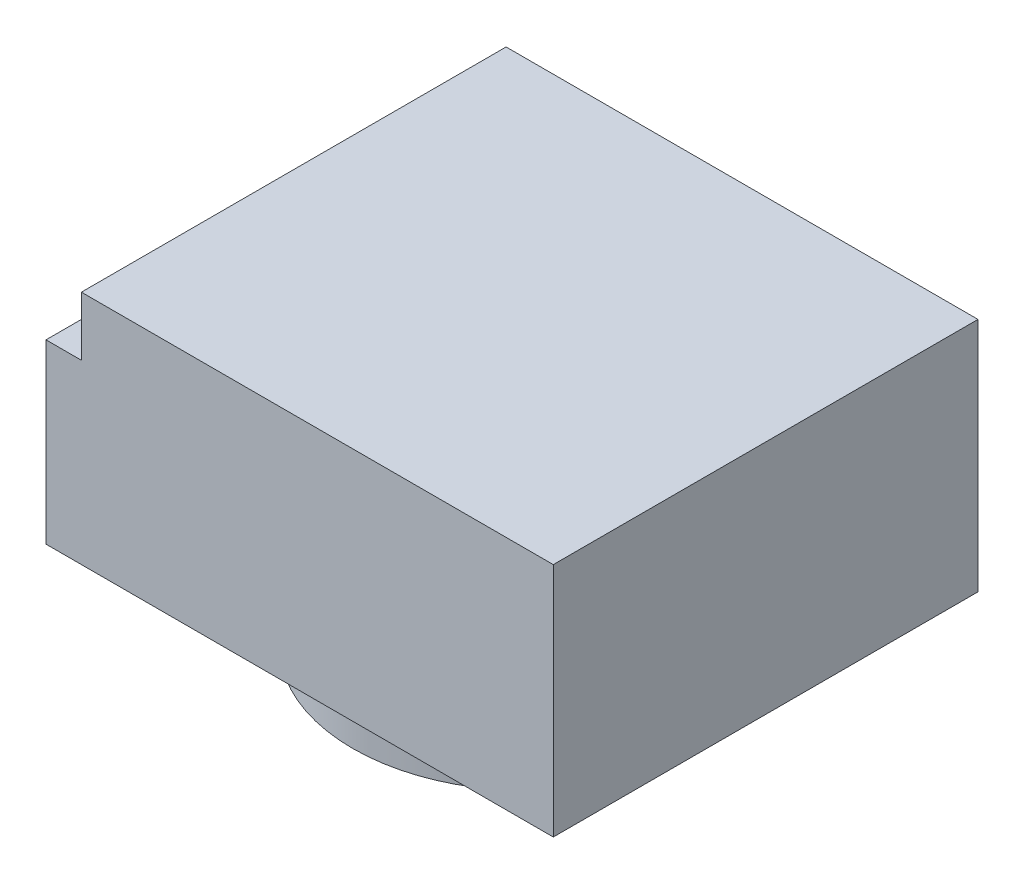
ISO-10303-21;
HEADER;
FILE_DESCRIPTION(('STEP AP214'),'2;1');
FILE_NAME('part.step','',(''),(''),'','','');
FILE_SCHEMA(('AUTOMOTIVE_DESIGN { 1 0 10303 214 1 1 1 1 }'));
ENDSEC;
DATA;
#1=APPLICATION_CONTEXT('core data for automotive mechanical design processes');
#2=APPLICATION_PROTOCOL_DEFINITION('international standard','automotive_design',2000,#1);
#3=PRODUCT_CONTEXT('',#1,'mechanical');
#4=PRODUCT('Part','Part','',(#3));
#5=PRODUCT_RELATED_PRODUCT_CATEGORY('part','',(#4));
#6=PRODUCT_DEFINITION_FORMATION('','',#4);
#7=PRODUCT_DEFINITION_CONTEXT('part definition',#1,'design');
#8=PRODUCT_DEFINITION('design','',#6,#7);
#9=PRODUCT_DEFINITION_SHAPE('','',#8);
#10=(LENGTH_UNIT() NAMED_UNIT(*) SI_UNIT(.MILLI.,.METRE.));
#11=(NAMED_UNIT(*) PLANE_ANGLE_UNIT() SI_UNIT($,.RADIAN.));
#12=(NAMED_UNIT(*) SI_UNIT($,.STERADIAN.) SOLID_ANGLE_UNIT());
#13=UNCERTAINTY_MEASURE_WITH_UNIT(LENGTH_MEASURE(1.E-05),#10,'distance_accuracy_value','');
#14=(GEOMETRIC_REPRESENTATION_CONTEXT(3) GLOBAL_UNCERTAINTY_ASSIGNED_CONTEXT((#13)) GLOBAL_UNIT_ASSIGNED_CONTEXT((#10,
#11,#12)) REPRESENTATION_CONTEXT('',''));
#15=CARTESIAN_POINT('',(0.,0.,0.));
#16=DIRECTION('',(0.,0.,1.));
#17=DIRECTION('',(1.,0.,0.));
#18=AXIS2_PLACEMENT_3D('',#15,#16,#17);
#19=CARTESIAN_POINT('',(-20.,20.,18.));
#20=DIRECTION('',(1.,0.,0.));
#21=DIRECTION('',(0.,0.,-1.));
#22=AXIS2_PLACEMENT_3D('',#19,#20,#21);
#23=PLANE('',#22);
#24=DIRECTION('',(0.,0.,-1.));
#25=VECTOR('',#24,1.);
#26=CARTESIAN_POINT('',(-20.,15.,18.));
#27=LINE('',#26,#25);
#28=CARTESIAN_POINT('',(-20.,15.,18.));
#29=VERTEX_POINT('',#28);
#30=CARTESIAN_POINT('',(-20.,15.,-18.));
#31=VERTEX_POINT('',#30);
#32=EDGE_CURVE('E54',#29,#31,#27,.T.);
#33=ORIENTED_EDGE('',*,*,#32,.F.);
#34=DIRECTION('',(0.,-1.,0.));
#35=VECTOR('',#34,1.);
#36=CARTESIAN_POINT('',(-20.,20.,18.));
#37=LINE('',#36,#35);
#38=CARTESIAN_POINT('',(-20.,20.,18.));
#39=VERTEX_POINT('',#38);
#40=EDGE_CURVE('E103',#39,#29,#37,.T.);
#41=ORIENTED_EDGE('',*,*,#40,.F.);
#42=DIRECTION('',(0.,0.,1.));
#43=VECTOR('',#42,1.);
#44=CARTESIAN_POINT('',(-20.,20.,18.));
#45=LINE('',#44,#43);
#46=CARTESIAN_POINT('',(-20.,20.,-18.));
#47=VERTEX_POINT('',#46);
#48=EDGE_CURVE('E101',#47,#39,#45,.T.);
#49=ORIENTED_EDGE('',*,*,#48,.F.);
#50=DIRECTION('',(0.,-1.,0.));
#51=VECTOR('',#50,1.);
#52=CARTESIAN_POINT('',(-20.,20.,-18.));
#53=LINE('',#52,#51);
#54=EDGE_CURVE('E100',#47,#31,#53,.T.);
#55=ORIENTED_EDGE('',*,*,#54,.T.);
#56=EDGE_LOOP('',(#33,#41,#49,#55));
#57=FACE_BOUND('',#56,.T.);
#58=ADVANCED_FACE('F39',(#57),#23,.F.);
#59=CARTESIAN_POINT('',(20.,20.,18.));
#60=DIRECTION('',(-1.,0.,0.));
#61=DIRECTION('',(0.,0.,1.));
#62=AXIS2_PLACEMENT_3D('',#59,#60,#61);
#63=PLANE('',#62);
#64=DIRECTION('',(0.,0.,-1.));
#65=VECTOR('',#64,1.);
#66=CARTESIAN_POINT('',(20.,0.,18.));
#67=LINE('',#66,#65);
#68=CARTESIAN_POINT('',(20.,0.,18.));
#69=VERTEX_POINT('',#68);
#70=CARTESIAN_POINT('',(20.,0.,-18.));
#71=VERTEX_POINT('',#70);
#72=EDGE_CURVE('E131',#69,#71,#67,.T.);
#73=ORIENTED_EDGE('',*,*,#72,.T.);
#74=DIRECTION('',(0.,-1.,0.));
#75=VECTOR('',#74,1.);
#76=CARTESIAN_POINT('',(20.,20.,-18.));
#77=LINE('',#76,#75);
#78=CARTESIAN_POINT('',(20.,20.,-18.));
#79=VERTEX_POINT('',#78);
#80=EDGE_CURVE('E47',#79,#71,#77,.T.);
#81=ORIENTED_EDGE('',*,*,#80,.F.);
#82=DIRECTION('',(0.,0.,-1.));
#83=VECTOR('',#82,1.);
#84=CARTESIAN_POINT('',(20.,20.,18.));
#85=LINE('',#84,#83);
#86=CARTESIAN_POINT('',(20.,20.,18.));
#87=VERTEX_POINT('',#86);
#88=EDGE_CURVE('E132',#87,#79,#85,.T.);
#89=ORIENTED_EDGE('',*,*,#88,.F.);
#90=DIRECTION('',(0.,-1.,0.));
#91=VECTOR('',#90,1.);
#92=CARTESIAN_POINT('',(20.,20.,18.));
#93=LINE('',#92,#91);
#94=EDGE_CURVE('E137',#87,#69,#93,.T.);
#95=ORIENTED_EDGE('',*,*,#94,.T.);
#96=EDGE_LOOP('',(#73,#81,#89,#95));
#97=FACE_BOUND('',#96,.T.);
#98=ADVANCED_FACE('F41',(#97),#63,.F.);
#99=CARTESIAN_POINT('',(-20.,20.,-18.));
#100=DIRECTION('',(0.,0.,1.));
#101=DIRECTION('',(1.,0.,0.));
#102=AXIS2_PLACEMENT_3D('',#99,#100,#101);
#103=PLANE('',#102);
#104=DIRECTION('',(-1.,0.,0.));
#105=VECTOR('',#104,1.);
#106=CARTESIAN_POINT('',(-20.,0.,-18.));
#107=LINE('',#106,#105);
#108=CARTESIAN_POINT('',(-23.,0.,-18.));
#109=VERTEX_POINT('',#108);
#110=EDGE_CURVE('E140',#71,#109,#107,.T.);
#111=ORIENTED_EDGE('',*,*,#110,.T.);
#112=DIRECTION('',(0.,-1.,0.));
#113=VECTOR('',#112,1.);
#114=CARTESIAN_POINT('',(-23.,0.,-18.));
#115=LINE('',#114,#113);
#116=CARTESIAN_POINT('',(-23.,15.,-18.));
#117=VERTEX_POINT('',#116);
#118=EDGE_CURVE('E118',#117,#109,#115,.T.);
#119=ORIENTED_EDGE('',*,*,#118,.F.);
#120=DIRECTION('',(-1.,0.,0.));
#121=VECTOR('',#120,1.);
#122=CARTESIAN_POINT('',(-23.,15.,-18.));
#123=LINE('',#122,#121);
#124=EDGE_CURVE('E110',#31,#117,#123,.T.);
#125=ORIENTED_EDGE('',*,*,#124,.F.);
#126=ORIENTED_EDGE('',*,*,#54,.F.);
#127=DIRECTION('',(-1.,0.,0.));
#128=VECTOR('',#127,1.);
#129=CARTESIAN_POINT('',(-20.,20.,-18.));
#130=LINE('',#129,#128);
#131=EDGE_CURVE('E86',#79,#47,#130,.T.);
#132=ORIENTED_EDGE('',*,*,#131,.F.);
#133=ORIENTED_EDGE('',*,*,#80,.T.);
#134=EDGE_LOOP('',(#111,#119,#125,#126,#132,#133));
#135=FACE_BOUND('',#134,.T.);
#136=ADVANCED_FACE('F116',(#135),#103,.F.);
#137=CARTESIAN_POINT('',(-20.,20.,18.));
#138=DIRECTION('',(0.,0.,-1.));
#139=DIRECTION('',(-1.,0.,0.));
#140=AXIS2_PLACEMENT_3D('',#137,#138,#139);
#141=PLANE('',#140);
#142=DIRECTION('',(1.,0.,0.));
#143=VECTOR('',#142,1.);
#144=CARTESIAN_POINT('',(-20.,0.,18.));
#145=LINE('',#144,#143);
#146=CARTESIAN_POINT('',(-23.,0.,18.));
#147=VERTEX_POINT('',#146);
#148=EDGE_CURVE('E78',#147,#69,#145,.T.);
#149=ORIENTED_EDGE('',*,*,#148,.T.);
#150=ORIENTED_EDGE('',*,*,#94,.F.);
#151=DIRECTION('',(1.,0.,0.));
#152=VECTOR('',#151,1.);
#153=CARTESIAN_POINT('',(-20.,20.,18.));
#154=LINE('',#153,#152);
#155=EDGE_CURVE('E63',#39,#87,#154,.T.);
#156=ORIENTED_EDGE('',*,*,#155,.F.);
#157=ORIENTED_EDGE('',*,*,#40,.T.);
#158=DIRECTION('',(-1.,0.,0.));
#159=VECTOR('',#158,1.);
#160=CARTESIAN_POINT('',(-23.,15.,18.));
#161=LINE('',#160,#159);
#162=CARTESIAN_POINT('',(-23.,15.,18.));
#163=VERTEX_POINT('',#162);
#164=EDGE_CURVE('E111',#29,#163,#161,.T.);
#165=ORIENTED_EDGE('',*,*,#164,.T.);
#166=DIRECTION('',(0.,-1.,0.));
#167=VECTOR('',#166,1.);
#168=CARTESIAN_POINT('',(-23.,0.,18.));
#169=LINE('',#168,#167);
#170=EDGE_CURVE('E123',#163,#147,#169,.T.);
#171=ORIENTED_EDGE('',*,*,#170,.T.);
#172=EDGE_LOOP('',(#149,#150,#156,#157,#165,#171));
#173=FACE_BOUND('',#172,.T.);
#174=ADVANCED_FACE('F154',(#173),#141,.F.);
#175=CARTESIAN_POINT('',(0.,20.,0.));
#176=DIRECTION('',(0.,-1.,0.));
#177=DIRECTION('',(0.,0.,-1.));
#178=AXIS2_PLACEMENT_3D('',#175,#176,#177);
#179=PLANE('',#178);
#180=ORIENTED_EDGE('',*,*,#88,.T.);
#181=ORIENTED_EDGE('',*,*,#131,.T.);
#182=ORIENTED_EDGE('',*,*,#48,.T.);
#183=ORIENTED_EDGE('',*,*,#155,.T.);
#184=EDGE_LOOP('',(#180,#181,#182,#183));
#185=FACE_BOUND('',#184,.T.);
#186=ADVANCED_FACE('F155',(#185),#179,.F.);
#187=CARTESIAN_POINT('',(0.,0.,0.));
#188=DIRECTION('',(0.,-1.,0.));
#189=DIRECTION('',(0.,0.,-1.));
#190=AXIS2_PLACEMENT_3D('',#187,#188,#189);
#191=PLANE('',#190);
#192=CARTESIAN_POINT('',(0.,0.,0.));
#193=DIRECTION('',(0.,-1.,0.));
#194=DIRECTION('',(0.,0.,-1.));
#195=AXIS2_PLACEMENT_3D('',#192,#193,#194);
#196=CIRCLE('',#195,15.);
#197=CARTESIAN_POINT('',(0.,0.,-15.));
#198=VERTEX_POINT('',#197);
#199=EDGE_CURVE('E11',#198,#198,#196,.T.);
#200=ORIENTED_EDGE('',*,*,#199,.F.);
#201=EDGE_LOOP('',(#200));
#202=FACE_BOUND('',#201,.T.);
#203=ORIENTED_EDGE('',*,*,#72,.F.);
#204=ORIENTED_EDGE('',*,*,#148,.F.);
#205=DIRECTION('',(0.,0.,-1.));
#206=VECTOR('',#205,1.);
#207=CARTESIAN_POINT('',(-23.,0.,18.));
#208=LINE('',#207,#206);
#209=EDGE_CURVE('E125',#147,#109,#208,.T.);
#210=ORIENTED_EDGE('',*,*,#209,.T.);
#211=ORIENTED_EDGE('',*,*,#110,.F.);
#212=EDGE_LOOP('',(#203,#204,#210,#211));
#213=FACE_BOUND('',#212,.T.);
#214=ADVANCED_FACE('F149',(#202,#213),#191,.T.);
#215=CARTESIAN_POINT('',(0.,0.,0.));
#216=DIRECTION('',(0.,1.,0.));
#217=DIRECTION('',(0.,0.,1.));
#218=AXIS2_PLACEMENT_3D('',#215,#216,#217);
#219=CYLINDRICAL_SURFACE('',#218,15.);
#220=ORIENTED_EDGE('',*,*,#199,.T.);
#221=EDGE_LOOP('',(#220));
#222=FACE_BOUND('',#221,.T.);
#223=CARTESIAN_POINT('',(0.,-5.,0.));
#224=DIRECTION('',(0.,1.,0.));
#225=DIRECTION('',(0.,0.,1.));
#226=AXIS2_PLACEMENT_3D('',#223,#224,#225);
#227=CIRCLE('',#226,15.);
#228=CARTESIAN_POINT('',(0.,-5.,15.));
#229=VERTEX_POINT('',#228);
#230=EDGE_CURVE('E112',#229,#229,#227,.T.);
#231=ORIENTED_EDGE('',*,*,#230,.T.);
#232=EDGE_LOOP('',(#231));
#233=FACE_BOUND('',#232,.T.);
#234=ADVANCED_FACE('F162',(#222,#233),#219,.T.);
#235=CARTESIAN_POINT('',(0.,-5.,15.));
#236=DIRECTION('',(0.,-1.,0.));
#237=DIRECTION('',(0.,0.,-1.));
#238=AXIS2_PLACEMENT_3D('',#235,#236,#237);
#239=PLANE('',#238);
#240=ORIENTED_EDGE('',*,*,#230,.F.);
#241=EDGE_LOOP('',(#240));
#242=FACE_BOUND('',#241,.T.);
#243=ADVANCED_FACE('F199',(#242),#239,.T.);
#244=CARTESIAN_POINT('',(-23.,15.,18.));
#245=DIRECTION('',(0.,-1.,0.));
#246=DIRECTION('',(0.,0.,-1.));
#247=AXIS2_PLACEMENT_3D('',#244,#245,#246);
#248=PLANE('',#247);
#249=ORIENTED_EDGE('',*,*,#32,.T.);
#250=ORIENTED_EDGE('',*,*,#124,.T.);
#251=DIRECTION('',(0.,0.,-1.));
#252=VECTOR('',#251,1.);
#253=CARTESIAN_POINT('',(-23.,15.,18.));
#254=LINE('',#253,#252);
#255=EDGE_CURVE('E113',#163,#117,#254,.T.);
#256=ORIENTED_EDGE('',*,*,#255,.F.);
#257=ORIENTED_EDGE('',*,*,#164,.F.);
#258=EDGE_LOOP('',(#249,#250,#256,#257));
#259=FACE_BOUND('',#258,.T.);
#260=ADVANCED_FACE('F108',(#259),#248,.F.);
#261=CARTESIAN_POINT('',(-23.,0.,18.));
#262=DIRECTION('',(1.,0.,0.));
#263=DIRECTION('',(0.,0.,-1.));
#264=AXIS2_PLACEMENT_3D('',#261,#262,#263);
#265=PLANE('',#264);
#266=ORIENTED_EDGE('',*,*,#255,.T.);
#267=ORIENTED_EDGE('',*,*,#118,.T.);
#268=ORIENTED_EDGE('',*,*,#209,.F.);
#269=ORIENTED_EDGE('',*,*,#170,.F.);
#270=EDGE_LOOP('',(#266,#267,#268,#269));
#271=FACE_BOUND('',#270,.T.);
#272=ADVANCED_FACE('F153',(#271),#265,.F.);
#273=CLOSED_SHELL('',(#58,#98,#136,#174,#186,#214,#234,#243,#260,#272));
#274=MANIFOLD_SOLID_BREP('B2',#273);
#275=ADVANCED_BREP_SHAPE_REPRESENTATION('',(#18,#274),#14);
#276=SHAPE_DEFINITION_REPRESENTATION(#9,#275);
ENDSEC;
END-ISO-10303-21;
